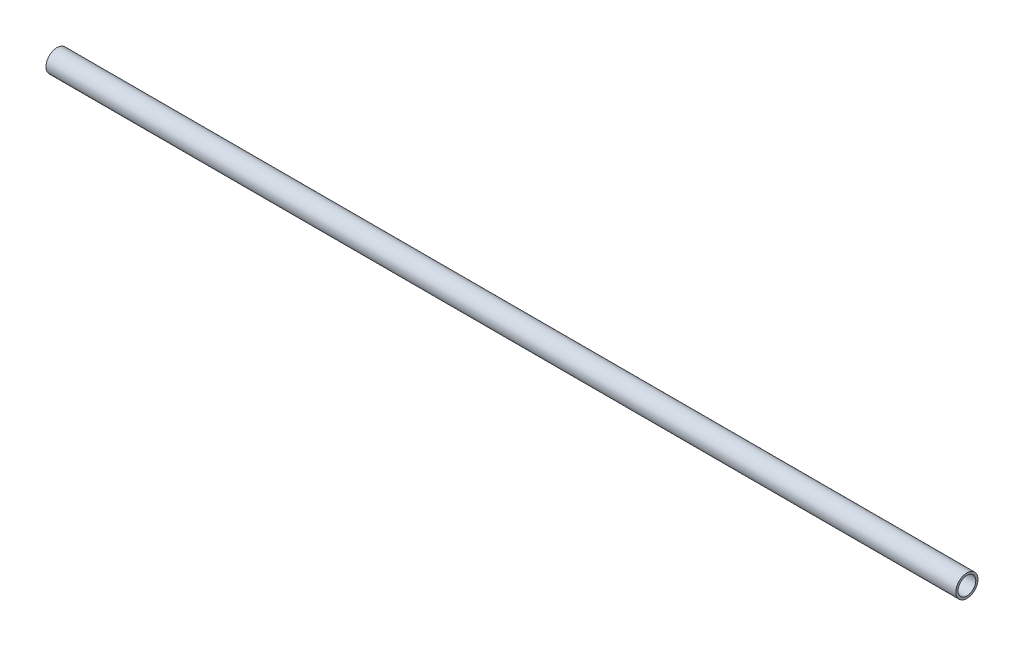
ISO-10303-21;
HEADER;
FILE_DESCRIPTION(('STEP AP214'),'2;1');
FILE_NAME('part.step','',(''),(''),'','','');
FILE_SCHEMA(('AUTOMOTIVE_DESIGN { 1 0 10303 214 1 1 1 1 }'));
ENDSEC;
DATA;
#1=APPLICATION_CONTEXT('core data for automotive mechanical design processes');
#2=APPLICATION_PROTOCOL_DEFINITION('international standard','automotive_design',2000,#1);
#3=PRODUCT_CONTEXT('',#1,'mechanical');
#4=PRODUCT('Part','Part','',(#3));
#5=PRODUCT_RELATED_PRODUCT_CATEGORY('part','',(#4));
#6=PRODUCT_DEFINITION_FORMATION('','',#4);
#7=PRODUCT_DEFINITION_CONTEXT('part definition',#1,'design');
#8=PRODUCT_DEFINITION('design','',#6,#7);
#9=PRODUCT_DEFINITION_SHAPE('','',#8);
#10=(LENGTH_UNIT() NAMED_UNIT(*) SI_UNIT(.MILLI.,.METRE.));
#11=(NAMED_UNIT(*) PLANE_ANGLE_UNIT() SI_UNIT($,.RADIAN.));
#12=(NAMED_UNIT(*) SI_UNIT($,.STERADIAN.) SOLID_ANGLE_UNIT());
#13=UNCERTAINTY_MEASURE_WITH_UNIT(LENGTH_MEASURE(1.E-05),#10,'distance_accuracy_value','');
#14=(GEOMETRIC_REPRESENTATION_CONTEXT(3) GLOBAL_UNCERTAINTY_ASSIGNED_CONTEXT((#13)) GLOBAL_UNIT_ASSIGNED_CONTEXT((#10,
#11,#12)) REPRESENTATION_CONTEXT('',''));
#15=CARTESIAN_POINT('',(0.,0.,0.));
#16=DIRECTION('',(0.,0.,1.));
#17=DIRECTION('',(1.,0.,0.));
#18=AXIS2_PLACEMENT_3D('',#15,#16,#17);
#19=CARTESIAN_POINT('',(410.,0.,0.));
#20=DIRECTION('',(1.,0.,0.));
#21=DIRECTION('',(0.,0.,-1.));
#22=AXIS2_PLACEMENT_3D('',#19,#20,#21);
#23=PLANE('',#22);
#24=CARTESIAN_POINT('',(410.,0.,0.));
#25=DIRECTION('',(1.,0.,0.));
#26=DIRECTION('',(0.,0.,-1.));
#27=AXIS2_PLACEMENT_3D('',#24,#25,#26);
#28=CIRCLE('',#27,5.);
#29=CARTESIAN_POINT('',(410.,0.,-5.));
#30=VERTEX_POINT('',#29);
#31=EDGE_CURVE('E10',#30,#30,#28,.T.);
#32=ORIENTED_EDGE('',*,*,#31,.T.);
#33=EDGE_LOOP('',(#32));
#34=FACE_BOUND('',#33,.T.);
#35=CARTESIAN_POINT('',(410.,0.,0.));
#36=DIRECTION('',(1.,0.,0.));
#37=DIRECTION('',(0.,0.,-1.));
#38=AXIS2_PLACEMENT_3D('',#35,#36,#37);
#39=CIRCLE('',#38,4.);
#40=CARTESIAN_POINT('',(410.,0.,-4.));
#41=VERTEX_POINT('',#40);
#42=EDGE_CURVE('E44',#41,#41,#39,.T.);
#43=ORIENTED_EDGE('',*,*,#42,.F.);
#44=EDGE_LOOP('',(#43));
#45=FACE_BOUND('',#44,.T.);
#46=ADVANCED_FACE('F33',(#34,#45),#23,.T.);
#47=CARTESIAN_POINT('',(0.,0.,0.));
#48=DIRECTION('',(1.,0.,0.));
#49=DIRECTION('',(0.,0.,-1.));
#50=AXIS2_PLACEMENT_3D('',#47,#48,#49);
#51=PLANE('',#50);
#52=CARTESIAN_POINT('',(0.,0.,0.));
#53=DIRECTION('',(1.,0.,0.));
#54=DIRECTION('',(0.,0.,-1.));
#55=AXIS2_PLACEMENT_3D('',#52,#53,#54);
#56=CIRCLE('',#55,5.);
#57=CARTESIAN_POINT('',(0.,0.,-5.));
#58=VERTEX_POINT('',#57);
#59=EDGE_CURVE('E37',#58,#58,#56,.T.);
#60=ORIENTED_EDGE('',*,*,#59,.F.);
#61=EDGE_LOOP('',(#60));
#62=FACE_BOUND('',#61,.T.);
#63=CARTESIAN_POINT('',(0.,0.,0.));
#64=DIRECTION('',(1.,0.,0.));
#65=DIRECTION('',(0.,0.,-1.));
#66=AXIS2_PLACEMENT_3D('',#63,#64,#65);
#67=CIRCLE('',#66,4.);
#68=CARTESIAN_POINT('',(0.,0.,-4.));
#69=VERTEX_POINT('',#68);
#70=EDGE_CURVE('E46',#69,#69,#67,.T.);
#71=ORIENTED_EDGE('',*,*,#70,.T.);
#72=EDGE_LOOP('',(#71));
#73=FACE_BOUND('',#72,.T.);
#74=ADVANCED_FACE('F56',(#62,#73),#51,.F.);
#75=CARTESIAN_POINT('',(410.,0.,0.));
#76=DIRECTION('',(-1.,0.,0.));
#77=DIRECTION('',(0.,0.,1.));
#78=AXIS2_PLACEMENT_3D('',#75,#76,#77);
#79=CYLINDRICAL_SURFACE('',#78,5.);
#80=ORIENTED_EDGE('',*,*,#31,.F.);
#81=EDGE_LOOP('',(#80));
#82=FACE_BOUND('',#81,.T.);
#83=ORIENTED_EDGE('',*,*,#59,.T.);
#84=EDGE_LOOP('',(#83));
#85=FACE_BOUND('',#84,.T.);
#86=ADVANCED_FACE('F35',(#82,#85),#79,.T.);
#87=CARTESIAN_POINT('',(410.,0.,0.));
#88=DIRECTION('',(-1.,0.,0.));
#89=DIRECTION('',(0.,0.,1.));
#90=AXIS2_PLACEMENT_3D('',#87,#88,#89);
#91=CYLINDRICAL_SURFACE('',#90,4.);
#92=ORIENTED_EDGE('',*,*,#42,.T.);
#93=EDGE_LOOP('',(#92));
#94=FACE_BOUND('',#93,.T.);
#95=ORIENTED_EDGE('',*,*,#70,.F.);
#96=EDGE_LOOP('',(#95));
#97=FACE_BOUND('',#96,.T.);
#98=ADVANCED_FACE('F52',(#94,#97),#91,.F.);
#99=CLOSED_SHELL('',(#46,#74,#86,#98));
#100=MANIFOLD_SOLID_BREP('B2',#99);
#101=ADVANCED_BREP_SHAPE_REPRESENTATION('',(#18,#100),#14);
#102=SHAPE_DEFINITION_REPRESENTATION(#9,#101);
ENDSEC;
END-ISO-10303-21;
